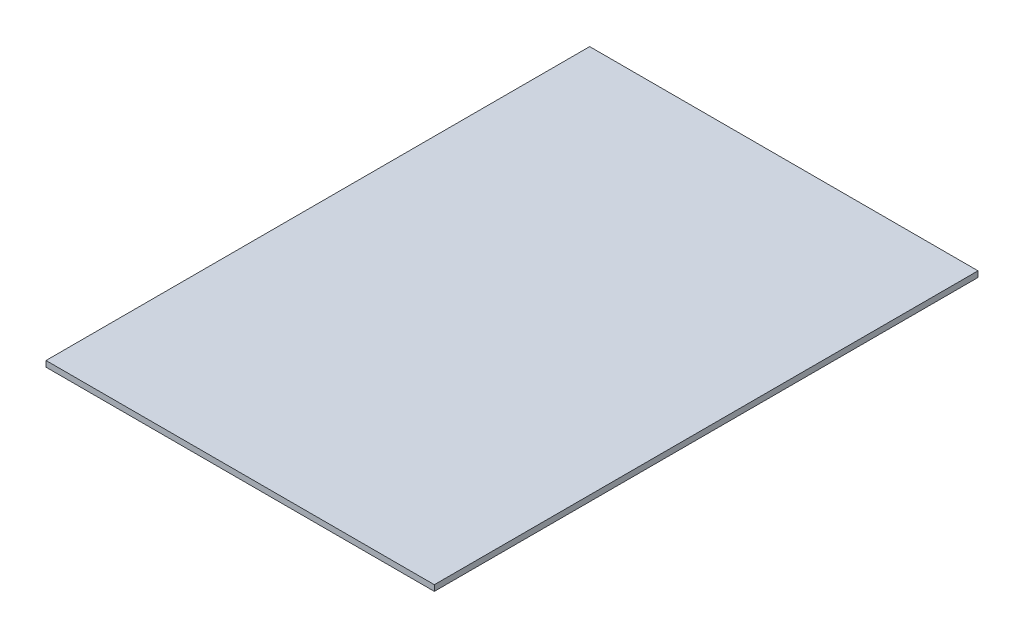
ISO-10303-21;
HEADER;
FILE_DESCRIPTION(('STEP AP214'),'2;1');
FILE_NAME('part.step','',(''),(''),'','','');
FILE_SCHEMA(('AUTOMOTIVE_DESIGN { 1 0 10303 214 1 1 1 1 }'));
ENDSEC;
DATA;
#1=APPLICATION_CONTEXT('core data for automotive mechanical design processes');
#2=APPLICATION_PROTOCOL_DEFINITION('international standard','automotive_design',2000,#1);
#3=PRODUCT_CONTEXT('',#1,'mechanical');
#4=PRODUCT('Part','Part','',(#3));
#5=PRODUCT_RELATED_PRODUCT_CATEGORY('part','',(#4));
#6=PRODUCT_DEFINITION_FORMATION('','',#4);
#7=PRODUCT_DEFINITION_CONTEXT('part definition',#1,'design');
#8=PRODUCT_DEFINITION('design','',#6,#7);
#9=PRODUCT_DEFINITION_SHAPE('','',#8);
#10=(LENGTH_UNIT() NAMED_UNIT(*) SI_UNIT(.MILLI.,.METRE.));
#11=(NAMED_UNIT(*) PLANE_ANGLE_UNIT() SI_UNIT($,.RADIAN.));
#12=(NAMED_UNIT(*) SI_UNIT($,.STERADIAN.) SOLID_ANGLE_UNIT());
#13=UNCERTAINTY_MEASURE_WITH_UNIT(LENGTH_MEASURE(1.E-05),#10,'distance_accuracy_value','');
#14=(GEOMETRIC_REPRESENTATION_CONTEXT(3) GLOBAL_UNCERTAINTY_ASSIGNED_CONTEXT((#13)) GLOBAL_UNIT_ASSIGNED_CONTEXT((#10,
#11,#12)) REPRESENTATION_CONTEXT('',''));
#15=CARTESIAN_POINT('',(0.,0.,0.));
#16=DIRECTION('',(0.,0.,1.));
#17=DIRECTION('',(1.,0.,0.));
#18=AXIS2_PLACEMENT_3D('',#15,#16,#17);
#19=CARTESIAN_POINT('',(0.,3.,0.));
#20=DIRECTION('',(1.,0.,0.));
#21=DIRECTION('',(0.,0.,-1.));
#22=AXIS2_PLACEMENT_3D('',#19,#20,#21);
#23=PLANE('',#22);
#24=DIRECTION('',(0.,0.,1.));
#25=VECTOR('',#24,1.);
#26=CARTESIAN_POINT('',(0.,0.,0.));
#27=LINE('',#26,#25);
#28=CARTESIAN_POINT('',(0.,0.,-280.));
#29=VERTEX_POINT('',#28);
#30=CARTESIAN_POINT('',(0.,0.,0.));
#31=VERTEX_POINT('',#30);
#32=EDGE_CURVE('E94',#29,#31,#27,.T.);
#33=ORIENTED_EDGE('',*,*,#32,.T.);
#34=DIRECTION('',(0.,-1.,0.));
#35=VECTOR('',#34,1.);
#36=CARTESIAN_POINT('',(0.,3.,0.));
#37=LINE('',#36,#35);
#38=CARTESIAN_POINT('',(0.,3.,0.));
#39=VERTEX_POINT('',#38);
#40=EDGE_CURVE('E11',#39,#31,#37,.T.);
#41=ORIENTED_EDGE('',*,*,#40,.F.);
#42=DIRECTION('',(0.,0.,1.));
#43=VECTOR('',#42,1.);
#44=CARTESIAN_POINT('',(0.,3.,0.));
#45=LINE('',#44,#43);
#46=CARTESIAN_POINT('',(0.,3.,-280.));
#47=VERTEX_POINT('',#46);
#48=EDGE_CURVE('E82',#47,#39,#45,.T.);
#49=ORIENTED_EDGE('',*,*,#48,.F.);
#50=DIRECTION('',(0.,-1.,0.));
#51=VECTOR('',#50,1.);
#52=CARTESIAN_POINT('',(0.,3.,-280.));
#53=LINE('',#52,#51);
#54=EDGE_CURVE('E90',#47,#29,#53,.T.);
#55=ORIENTED_EDGE('',*,*,#54,.T.);
#56=EDGE_LOOP('',(#33,#41,#49,#55));
#57=FACE_BOUND('',#56,.T.);
#58=ADVANCED_FACE('F31',(#57),#23,.F.);
#59=CARTESIAN_POINT('',(0.,3.,0.));
#60=DIRECTION('',(0.,0.,-1.));
#61=DIRECTION('',(-1.,0.,0.));
#62=AXIS2_PLACEMENT_3D('',#59,#60,#61);
#63=PLANE('',#62);
#64=DIRECTION('',(1.,0.,0.));
#65=VECTOR('',#64,1.);
#66=CARTESIAN_POINT('',(0.,0.,0.));
#67=LINE('',#66,#65);
#68=CARTESIAN_POINT('',(200.,0.,0.));
#69=VERTEX_POINT('',#68);
#70=EDGE_CURVE('E86',#31,#69,#67,.T.);
#71=ORIENTED_EDGE('',*,*,#70,.T.);
#72=DIRECTION('',(0.,-1.,0.));
#73=VECTOR('',#72,1.);
#74=CARTESIAN_POINT('',(200.,3.,0.));
#75=LINE('',#74,#73);
#76=CARTESIAN_POINT('',(200.,3.,0.));
#77=VERTEX_POINT('',#76);
#78=EDGE_CURVE('E39',#77,#69,#75,.T.);
#79=ORIENTED_EDGE('',*,*,#78,.F.);
#80=DIRECTION('',(1.,0.,0.));
#81=VECTOR('',#80,1.);
#82=CARTESIAN_POINT('',(0.,3.,0.));
#83=LINE('',#82,#81);
#84=EDGE_CURVE('E77',#39,#77,#83,.T.);
#85=ORIENTED_EDGE('',*,*,#84,.F.);
#86=ORIENTED_EDGE('',*,*,#40,.T.);
#87=EDGE_LOOP('',(#71,#79,#85,#86));
#88=FACE_BOUND('',#87,.T.);
#89=ADVANCED_FACE('F85',(#88),#63,.F.);
#90=CARTESIAN_POINT('',(200.,3.,0.));
#91=DIRECTION('',(-1.,0.,0.));
#92=DIRECTION('',(0.,0.,1.));
#93=AXIS2_PLACEMENT_3D('',#90,#91,#92);
#94=PLANE('',#93);
#95=DIRECTION('',(0.,0.,-1.));
#96=VECTOR('',#95,1.);
#97=CARTESIAN_POINT('',(200.,0.,0.));
#98=LINE('',#97,#96);
#99=CARTESIAN_POINT('',(200.,0.,-280.));
#100=VERTEX_POINT('',#99);
#101=EDGE_CURVE('E64',#69,#100,#98,.T.);
#102=ORIENTED_EDGE('',*,*,#101,.T.);
#103=DIRECTION('',(0.,-1.,0.));
#104=VECTOR('',#103,1.);
#105=CARTESIAN_POINT('',(200.,3.,-280.));
#106=LINE('',#105,#104);
#107=CARTESIAN_POINT('',(200.,3.,-280.));
#108=VERTEX_POINT('',#107);
#109=EDGE_CURVE('E87',#108,#100,#106,.T.);
#110=ORIENTED_EDGE('',*,*,#109,.F.);
#111=DIRECTION('',(0.,0.,-1.));
#112=VECTOR('',#111,1.);
#113=CARTESIAN_POINT('',(200.,3.,0.));
#114=LINE('',#113,#112);
#115=EDGE_CURVE('E80',#77,#108,#114,.T.);
#116=ORIENTED_EDGE('',*,*,#115,.F.);
#117=ORIENTED_EDGE('',*,*,#78,.T.);
#118=EDGE_LOOP('',(#102,#110,#116,#117));
#119=FACE_BOUND('',#118,.T.);
#120=ADVANCED_FACE('F88',(#119),#94,.F.);
#121=CARTESIAN_POINT('',(0.,3.,-280.));
#122=DIRECTION('',(0.,0.,1.));
#123=DIRECTION('',(1.,0.,0.));
#124=AXIS2_PLACEMENT_3D('',#121,#122,#123);
#125=PLANE('',#124);
#126=DIRECTION('',(-1.,0.,0.));
#127=VECTOR('',#126,1.);
#128=CARTESIAN_POINT('',(0.,0.,-280.));
#129=LINE('',#128,#127);
#130=EDGE_CURVE('E70',#100,#29,#129,.T.);
#131=ORIENTED_EDGE('',*,*,#130,.T.);
#132=ORIENTED_EDGE('',*,*,#54,.F.);
#133=DIRECTION('',(-1.,0.,0.));
#134=VECTOR('',#133,1.);
#135=CARTESIAN_POINT('',(0.,3.,-280.));
#136=LINE('',#135,#134);
#137=EDGE_CURVE('E47',#108,#47,#136,.T.);
#138=ORIENTED_EDGE('',*,*,#137,.F.);
#139=ORIENTED_EDGE('',*,*,#109,.T.);
#140=EDGE_LOOP('',(#131,#132,#138,#139));
#141=FACE_BOUND('',#140,.T.);
#142=ADVANCED_FACE('F101',(#141),#125,.F.);
#143=CARTESIAN_POINT('',(0.,3.,-280.));
#144=DIRECTION('',(0.,-1.,0.));
#145=DIRECTION('',(0.,0.,-1.));
#146=AXIS2_PLACEMENT_3D('',#143,#144,#145);
#147=PLANE('',#146);
#148=ORIENTED_EDGE('',*,*,#48,.T.);
#149=ORIENTED_EDGE('',*,*,#84,.T.);
#150=ORIENTED_EDGE('',*,*,#115,.T.);
#151=ORIENTED_EDGE('',*,*,#137,.T.);
#152=EDGE_LOOP('',(#148,#149,#150,#151));
#153=FACE_BOUND('',#152,.T.);
#154=ADVANCED_FACE('F78',(#153),#147,.F.);
#155=CARTESIAN_POINT('',(0.,0.,-280.));
#156=DIRECTION('',(0.,-1.,0.));
#157=DIRECTION('',(0.,0.,-1.));
#158=AXIS2_PLACEMENT_3D('',#155,#156,#157);
#159=PLANE('',#158);
#160=ORIENTED_EDGE('',*,*,#32,.F.);
#161=ORIENTED_EDGE('',*,*,#130,.F.);
#162=ORIENTED_EDGE('',*,*,#101,.F.);
#163=ORIENTED_EDGE('',*,*,#70,.F.);
#164=EDGE_LOOP('',(#160,#161,#162,#163));
#165=FACE_BOUND('',#164,.T.);
#166=ADVANCED_FACE('F104',(#165),#159,.T.);
#167=CLOSED_SHELL('',(#58,#89,#120,#142,#154,#166));
#168=MANIFOLD_SOLID_BREP('B2',#167);
#169=ADVANCED_BREP_SHAPE_REPRESENTATION('',(#18,#168),#14);
#170=SHAPE_DEFINITION_REPRESENTATION(#9,#169);
ENDSEC;
END-ISO-10303-21;
